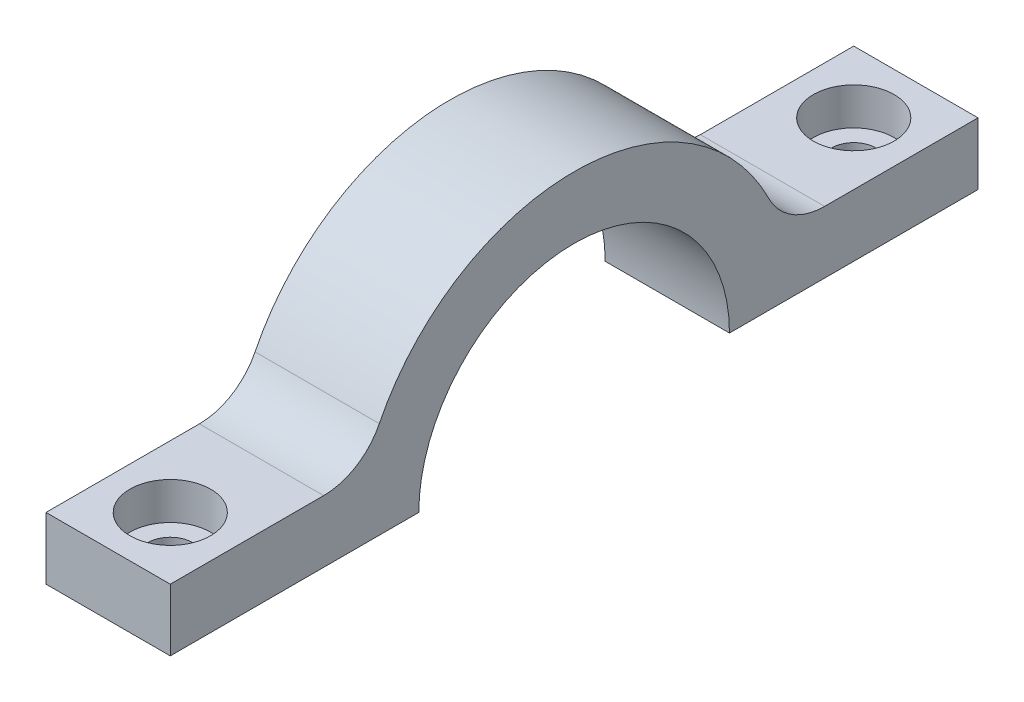
ISO-10303-21;
HEADER;
FILE_DESCRIPTION(('STEP AP214'),'2;1');
FILE_NAME('part.step','',(''),(''),'','','');
FILE_SCHEMA(('AUTOMOTIVE_DESIGN { 1 0 10303 214 1 1 1 1 }'));
ENDSEC;
DATA;
#1=APPLICATION_CONTEXT('core data for automotive mechanical design processes');
#2=APPLICATION_PROTOCOL_DEFINITION('international standard','automotive_design',2000,#1);
#3=PRODUCT_CONTEXT('',#1,'mechanical');
#4=PRODUCT('Part','Part','',(#3));
#5=PRODUCT_RELATED_PRODUCT_CATEGORY('part','',(#4));
#6=PRODUCT_DEFINITION_FORMATION('','',#4);
#7=PRODUCT_DEFINITION_CONTEXT('part definition',#1,'design');
#8=PRODUCT_DEFINITION('design','',#6,#7);
#9=PRODUCT_DEFINITION_SHAPE('','',#8);
#10=(LENGTH_UNIT() NAMED_UNIT(*) SI_UNIT(.MILLI.,.METRE.));
#11=(NAMED_UNIT(*) PLANE_ANGLE_UNIT() SI_UNIT($,.RADIAN.));
#12=(NAMED_UNIT(*) SI_UNIT($,.STERADIAN.) SOLID_ANGLE_UNIT());
#13=UNCERTAINTY_MEASURE_WITH_UNIT(LENGTH_MEASURE(1.E-05),#10,'distance_accuracy_value','');
#14=(GEOMETRIC_REPRESENTATION_CONTEXT(3) GLOBAL_UNCERTAINTY_ASSIGNED_CONTEXT((#13)) GLOBAL_UNIT_ASSIGNED_CONTEXT((#10,
#11,#12)) REPRESENTATION_CONTEXT('',''));
#15=CARTESIAN_POINT('',(0.,0.,0.));
#16=DIRECTION('',(0.,0.,1.));
#17=DIRECTION('',(1.,0.,0.));
#18=AXIS2_PLACEMENT_3D('',#15,#16,#17);
#19=CARTESIAN_POINT('',(5.,0.,0.));
#20=DIRECTION('',(-1.,0.,0.));
#21=DIRECTION('',(0.,0.,1.));
#22=AXIS2_PLACEMENT_3D('',#19,#20,#21);
#23=CYLINDRICAL_SURFACE('',#22,12.5);
#24=CARTESIAN_POINT('',(-5.,0.,0.));
#25=DIRECTION('',(-1.,0.,0.));
#26=DIRECTION('',(0.,0.,1.));
#27=AXIS2_PLACEMENT_3D('',#24,#25,#26);
#28=CIRCLE('',#27,12.5);
#29=CARTESIAN_POINT('',(-5.,0.,12.5));
#30=VERTEX_POINT('',#29);
#31=CARTESIAN_POINT('',(-5.,0.,-12.5));
#32=VERTEX_POINT('',#31);
#33=EDGE_CURVE('E136',#30,#32,#28,.T.);
#34=ORIENTED_EDGE('',*,*,#33,.T.);
#35=DIRECTION('',(-1.,0.,0.));
#36=VECTOR('',#35,1.);
#37=CARTESIAN_POINT('',(5.,0.,-12.5));
#38=LINE('',#37,#36);
#39=CARTESIAN_POINT('',(5.,0.,-12.5));
#40=VERTEX_POINT('',#39);
#41=EDGE_CURVE('E118',#40,#32,#38,.T.);
#42=ORIENTED_EDGE('',*,*,#41,.F.);
#43=CARTESIAN_POINT('',(5.,0.,0.));
#44=DIRECTION('',(-1.,0.,0.));
#45=DIRECTION('',(0.,0.,1.));
#46=AXIS2_PLACEMENT_3D('',#43,#44,#45);
#47=CIRCLE('',#46,12.5);
#48=CARTESIAN_POINT('',(5.,0.,12.5));
#49=VERTEX_POINT('',#48);
#50=EDGE_CURVE('E124',#49,#40,#47,.T.);
#51=ORIENTED_EDGE('',*,*,#50,.F.);
#52=DIRECTION('',(-1.,0.,0.));
#53=VECTOR('',#52,1.);
#54=CARTESIAN_POINT('',(5.,0.,12.5));
#55=LINE('',#54,#53);
#56=EDGE_CURVE('E184',#49,#30,#55,.T.);
#57=ORIENTED_EDGE('',*,*,#56,.T.);
#58=EDGE_LOOP('',(#34,#42,#51,#57));
#59=FACE_BOUND('',#58,.T.);
#60=ADVANCED_FACE('F38',(#59),#23,.F.);
#61=CARTESIAN_POINT('',(5.,0.,-32.5));
#62=DIRECTION('',(0.,1.,0.));
#63=DIRECTION('',(0.,0.,1.));
#64=AXIS2_PLACEMENT_3D('',#61,#62,#63);
#65=PLANE('',#64);
#66=CARTESIAN_POINT('',(0.,0.,-27.5));
#67=DIRECTION('',(0.,1.,0.));
#68=DIRECTION('',(0.,0.,1.));
#69=AXIS2_PLACEMENT_3D('',#66,#67,#68);
#70=CIRCLE('',#69,1.8);
#71=CARTESIAN_POINT('',(0.,0.,-25.7));
#72=VERTEX_POINT('',#71);
#73=EDGE_CURVE('E187',#72,#72,#70,.T.);
#74=ORIENTED_EDGE('',*,*,#73,.T.);
#75=EDGE_LOOP('',(#74));
#76=FACE_BOUND('',#75,.T.);
#77=DIRECTION('',(0.,0.,-1.));
#78=VECTOR('',#77,1.);
#79=CARTESIAN_POINT('',(-5.,0.,-32.5));
#80=LINE('',#79,#78);
#81=CARTESIAN_POINT('',(-5.,0.,-32.5));
#82=VERTEX_POINT('',#81);
#83=EDGE_CURVE('E186',#32,#82,#80,.T.);
#84=ORIENTED_EDGE('',*,*,#83,.T.);
#85=DIRECTION('',(-1.,0.,0.));
#86=VECTOR('',#85,1.);
#87=CARTESIAN_POINT('',(5.,0.,-32.5));
#88=LINE('',#87,#86);
#89=CARTESIAN_POINT('',(5.,0.,-32.5));
#90=VERTEX_POINT('',#89);
#91=EDGE_CURVE('E121',#90,#82,#88,.T.);
#92=ORIENTED_EDGE('',*,*,#91,.F.);
#93=DIRECTION('',(0.,0.,-1.));
#94=VECTOR('',#93,1.);
#95=CARTESIAN_POINT('',(5.,0.,-32.5));
#96=LINE('',#95,#94);
#97=EDGE_CURVE('E114',#40,#90,#96,.T.);
#98=ORIENTED_EDGE('',*,*,#97,.F.);
#99=ORIENTED_EDGE('',*,*,#41,.T.);
#100=EDGE_LOOP('',(#84,#92,#98,#99));
#101=FACE_BOUND('',#100,.T.);
#102=ADVANCED_FACE('F116',(#76,#101),#65,.F.);
#103=CARTESIAN_POINT('',(5.,5.,-32.5));
#104=DIRECTION('',(0.,0.,1.));
#105=DIRECTION('',(1.,0.,0.));
#106=AXIS2_PLACEMENT_3D('',#103,#104,#105);
#107=PLANE('',#106);
#108=DIRECTION('',(0.,1.,0.));
#109=VECTOR('',#108,1.);
#110=CARTESIAN_POINT('',(-5.,5.,-32.5));
#111=LINE('',#110,#109);
#112=CARTESIAN_POINT('',(-5.,5.,-32.5));
#113=VERTEX_POINT('',#112);
#114=EDGE_CURVE('E189',#82,#113,#111,.T.);
#115=ORIENTED_EDGE('',*,*,#114,.T.);
#116=DIRECTION('',(-1.,0.,0.));
#117=VECTOR('',#116,1.);
#118=CARTESIAN_POINT('',(5.,5.,-32.5));
#119=LINE('',#118,#117);
#120=CARTESIAN_POINT('',(5.,5.,-32.5));
#121=VERTEX_POINT('',#120);
#122=EDGE_CURVE('E141',#121,#113,#119,.T.);
#123=ORIENTED_EDGE('',*,*,#122,.F.);
#124=DIRECTION('',(0.,1.,0.));
#125=VECTOR('',#124,1.);
#126=CARTESIAN_POINT('',(5.,5.,-32.5));
#127=LINE('',#126,#125);
#128=EDGE_CURVE('E123',#90,#121,#127,.T.);
#129=ORIENTED_EDGE('',*,*,#128,.F.);
#130=ORIENTED_EDGE('',*,*,#91,.T.);
#131=EDGE_LOOP('',(#115,#123,#129,#130));
#132=FACE_BOUND('',#131,.T.);
#133=ADVANCED_FACE('F259',(#132),#107,.F.);
#134=CARTESIAN_POINT('',(5.,5.,-32.5));
#135=DIRECTION('',(0.,-1.,0.));
#136=DIRECTION('',(0.,0.,-1.));
#137=AXIS2_PLACEMENT_3D('',#134,#135,#136);
#138=PLANE('',#137);
#139=CARTESIAN_POINT('',(0.,5.,-27.5));
#140=DIRECTION('',(0.,1.,0.));
#141=DIRECTION('',(0.,0.,1.));
#142=AXIS2_PLACEMENT_3D('',#139,#140,#141);
#143=CIRCLE('',#142,3.25);
#144=CARTESIAN_POINT('',(0.,5.,-24.25));
#145=VERTEX_POINT('',#144);
#146=EDGE_CURVE('E224',#145,#145,#143,.T.);
#147=ORIENTED_EDGE('',*,*,#146,.F.);
#148=EDGE_LOOP('',(#147));
#149=FACE_BOUND('',#148,.T.);
#150=DIRECTION('',(0.,0.,1.));
#151=VECTOR('',#150,1.);
#152=CARTESIAN_POINT('',(-5.,5.,-32.5));
#153=LINE('',#152,#151);
#154=CARTESIAN_POINT('',(-5.,5.,-20.1556443707464));
#155=VERTEX_POINT('',#154);
#156=EDGE_CURVE('E166',#113,#155,#153,.T.);
#157=ORIENTED_EDGE('',*,*,#156,.T.);
#158=DIRECTION('',(1.,0.,0.));
#159=VECTOR('',#158,1.);
#160=CARTESIAN_POINT('',(5.,5.,-20.1556443707464));
#161=LINE('',#160,#159);
#162=CARTESIAN_POINT('',(5.,5.,-20.1556443707464));
#163=VERTEX_POINT('',#162);
#164=EDGE_CURVE('E147',#155,#163,#161,.T.);
#165=ORIENTED_EDGE('',*,*,#164,.T.);
#166=DIRECTION('',(0.,0.,1.));
#167=VECTOR('',#166,1.);
#168=CARTESIAN_POINT('',(5.,5.,-32.5));
#169=LINE('',#168,#167);
#170=EDGE_CURVE('E179',#121,#163,#169,.T.);
#171=ORIENTED_EDGE('',*,*,#170,.F.);
#172=ORIENTED_EDGE('',*,*,#122,.T.);
#173=EDGE_LOOP('',(#157,#165,#171,#172));
#174=FACE_BOUND('',#173,.T.);
#175=ADVANCED_FACE('F206',(#149,#174),#138,.F.);
#176=CARTESIAN_POINT('',(5.,0.,0.));
#177=DIRECTION('',(-1.,0.,0.));
#178=DIRECTION('',(0.,0.,1.));
#179=AXIS2_PLACEMENT_3D('',#176,#177,#178);
#180=CYLINDRICAL_SURFACE('',#179,17.5);
#181=CARTESIAN_POINT('',(5.,0.,0.));
#182=DIRECTION('',(1.,0.,0.));
#183=DIRECTION('',(0.,0.,1.));
#184=AXIS2_PLACEMENT_3D('',#181,#182,#183);
#185=CIRCLE('',#184,17.5);
#186=CARTESIAN_POINT('',(5.,7.77777777777778,-15.6766122883583));
#187=VERTEX_POINT('',#186);
#188=CARTESIAN_POINT('',(5.,7.77777777777778,15.6766122883583));
#189=VERTEX_POINT('',#188);
#190=EDGE_CURVE('E176',#187,#189,#185,.T.);
#191=ORIENTED_EDGE('',*,*,#190,.F.);
#192=DIRECTION('',(-1.,0.,0.));
#193=VECTOR('',#192,1.);
#194=CARTESIAN_POINT('',(5.,7.77777777777778,-15.6766122883583));
#195=LINE('',#194,#193);
#196=CARTESIAN_POINT('',(-5.,7.77777777777778,-15.6766122883583));
#197=VERTEX_POINT('',#196);
#198=EDGE_CURVE('E139',#187,#197,#195,.T.);
#199=ORIENTED_EDGE('',*,*,#198,.T.);
#200=CARTESIAN_POINT('',(-5.,0.,0.));
#201=DIRECTION('',(1.,0.,0.));
#202=DIRECTION('',(0.,0.,1.));
#203=AXIS2_PLACEMENT_3D('',#200,#201,#202);
#204=CIRCLE('',#203,17.5);
#205=CARTESIAN_POINT('',(-5.,7.77777777777778,15.6766122883583));
#206=VERTEX_POINT('',#205);
#207=EDGE_CURVE('E159',#197,#206,#204,.T.);
#208=ORIENTED_EDGE('',*,*,#207,.T.);
#209=DIRECTION('',(-1.,0.,0.));
#210=VECTOR('',#209,1.);
#211=CARTESIAN_POINT('',(5.,7.77777777777778,15.6766122883583));
#212=LINE('',#211,#210);
#213=EDGE_CURVE('E137',#206,#189,#212,.F.);
#214=ORIENTED_EDGE('',*,*,#213,.T.);
#215=EDGE_LOOP('',(#191,#199,#208,#214));
#216=FACE_BOUND('',#215,.T.);
#217=ADVANCED_FACE('F164',(#216),#180,.T.);
#218=CARTESIAN_POINT('',(5.,5.,32.5));
#219=DIRECTION('',(0.,-1.,0.));
#220=DIRECTION('',(0.,0.,-1.));
#221=AXIS2_PLACEMENT_3D('',#218,#219,#220);
#222=PLANE('',#221);
#223=CARTESIAN_POINT('',(0.,5.,27.5));
#224=DIRECTION('',(0.,1.,0.));
#225=DIRECTION('',(0.,0.,1.));
#226=AXIS2_PLACEMENT_3D('',#223,#224,#225);
#227=CIRCLE('',#226,3.25);
#228=CARTESIAN_POINT('',(0.,5.,30.75));
#229=VERTEX_POINT('',#228);
#230=EDGE_CURVE('E236',#229,#229,#227,.T.);
#231=ORIENTED_EDGE('',*,*,#230,.F.);
#232=EDGE_LOOP('',(#231));
#233=FACE_BOUND('',#232,.T.);
#234=DIRECTION('',(0.,0.,1.));
#235=VECTOR('',#234,1.);
#236=CARTESIAN_POINT('',(5.,5.,32.5));
#237=LINE('',#236,#235);
#238=CARTESIAN_POINT('',(5.,5.,20.1556443707464));
#239=VERTEX_POINT('',#238);
#240=CARTESIAN_POINT('',(5.,5.,32.5));
#241=VERTEX_POINT('',#240);
#242=EDGE_CURVE('E172',#239,#241,#237,.T.);
#243=ORIENTED_EDGE('',*,*,#242,.F.);
#244=DIRECTION('',(1.,0.,0.));
#245=VECTOR('',#244,1.);
#246=CARTESIAN_POINT('',(-5.,5.,20.1556443707464));
#247=LINE('',#246,#245);
#248=CARTESIAN_POINT('',(-5.,5.,20.1556443707464));
#249=VERTEX_POINT('',#248);
#250=EDGE_CURVE('E149',#239,#249,#247,.F.);
#251=ORIENTED_EDGE('',*,*,#250,.T.);
#252=DIRECTION('',(0.,0.,1.));
#253=VECTOR('',#252,1.);
#254=CARTESIAN_POINT('',(-5.,5.,32.5));
#255=LINE('',#254,#253);
#256=CARTESIAN_POINT('',(-5.,5.,32.5));
#257=VERTEX_POINT('',#256);
#258=EDGE_CURVE('E161',#249,#257,#255,.T.);
#259=ORIENTED_EDGE('',*,*,#258,.T.);
#260=DIRECTION('',(-1.,0.,0.));
#261=VECTOR('',#260,1.);
#262=CARTESIAN_POINT('',(5.,5.,32.5));
#263=LINE('',#262,#261);
#264=EDGE_CURVE('E173',#241,#257,#263,.T.);
#265=ORIENTED_EDGE('',*,*,#264,.F.);
#266=EDGE_LOOP('',(#243,#251,#259,#265));
#267=FACE_BOUND('',#266,.T.);
#268=ADVANCED_FACE('F169',(#233,#267),#222,.F.);
#269=CARTESIAN_POINT('',(5.,5.,32.5));
#270=DIRECTION('',(0.,0.,-1.));
#271=DIRECTION('',(-1.,0.,0.));
#272=AXIS2_PLACEMENT_3D('',#269,#270,#271);
#273=PLANE('',#272);
#274=DIRECTION('',(0.,-1.,0.));
#275=VECTOR('',#274,1.);
#276=CARTESIAN_POINT('',(-5.,5.,32.5));
#277=LINE('',#276,#275);
#278=CARTESIAN_POINT('',(-5.,0.,32.5));
#279=VERTEX_POINT('',#278);
#280=EDGE_CURVE('E194',#257,#279,#277,.T.);
#281=ORIENTED_EDGE('',*,*,#280,.T.);
#282=DIRECTION('',(-1.,0.,0.));
#283=VECTOR('',#282,1.);
#284=CARTESIAN_POINT('',(5.,0.,32.5));
#285=LINE('',#284,#283);
#286=CARTESIAN_POINT('',(5.,0.,32.5));
#287=VERTEX_POINT('',#286);
#288=EDGE_CURVE('E198',#287,#279,#285,.T.);
#289=ORIENTED_EDGE('',*,*,#288,.F.);
#290=DIRECTION('',(0.,-1.,0.));
#291=VECTOR('',#290,1.);
#292=CARTESIAN_POINT('',(5.,5.,32.5));
#293=LINE('',#292,#291);
#294=EDGE_CURVE('E175',#241,#287,#293,.T.);
#295=ORIENTED_EDGE('',*,*,#294,.F.);
#296=ORIENTED_EDGE('',*,*,#264,.T.);
#297=EDGE_LOOP('',(#281,#289,#295,#296));
#298=FACE_BOUND('',#297,.T.);
#299=ADVANCED_FACE('F243',(#298),#273,.F.);
#300=CARTESIAN_POINT('',(5.,0.,32.5));
#301=DIRECTION('',(0.,1.,0.));
#302=DIRECTION('',(0.,0.,1.));
#303=AXIS2_PLACEMENT_3D('',#300,#301,#302);
#304=PLANE('',#303);
#305=CARTESIAN_POINT('',(0.,0.,27.5));
#306=DIRECTION('',(0.,1.,0.));
#307=DIRECTION('',(0.,0.,1.));
#308=AXIS2_PLACEMENT_3D('',#305,#306,#307);
#309=CIRCLE('',#308,1.8);
#310=CARTESIAN_POINT('',(0.,0.,29.3));
#311=VERTEX_POINT('',#310);
#312=EDGE_CURVE('E227',#311,#311,#309,.T.);
#313=ORIENTED_EDGE('',*,*,#312,.T.);
#314=EDGE_LOOP('',(#313));
#315=FACE_BOUND('',#314,.T.);
#316=DIRECTION('',(0.,0.,-1.));
#317=VECTOR('',#316,1.);
#318=CARTESIAN_POINT('',(-5.,0.,32.5));
#319=LINE('',#318,#317);
#320=EDGE_CURVE('E133',#279,#30,#319,.T.);
#321=ORIENTED_EDGE('',*,*,#320,.T.);
#322=ORIENTED_EDGE('',*,*,#56,.F.);
#323=DIRECTION('',(0.,0.,-1.));
#324=VECTOR('',#323,1.);
#325=CARTESIAN_POINT('',(5.,0.,32.5));
#326=LINE('',#325,#324);
#327=EDGE_CURVE('E129',#287,#49,#326,.T.);
#328=ORIENTED_EDGE('',*,*,#327,.F.);
#329=ORIENTED_EDGE('',*,*,#288,.T.);
#330=EDGE_LOOP('',(#321,#322,#328,#329));
#331=FACE_BOUND('',#330,.T.);
#332=ADVANCED_FACE('F250',(#315,#331),#304,.F.);
#333=CARTESIAN_POINT('',(5.,0.,0.));
#334=DIRECTION('',(-1.,0.,0.));
#335=DIRECTION('',(0.,0.,1.));
#336=AXIS2_PLACEMENT_3D('',#333,#334,#335);
#337=PLANE('',#336);
#338=ORIENTED_EDGE('',*,*,#50,.T.);
#339=ORIENTED_EDGE('',*,*,#97,.T.);
#340=ORIENTED_EDGE('',*,*,#128,.T.);
#341=ORIENTED_EDGE('',*,*,#170,.T.);
#342=CARTESIAN_POINT('',(5.,10.,-20.1556443707464));
#343=DIRECTION('',(-1.,0.,0.));
#344=DIRECTION('',(0.,0.,1.));
#345=AXIS2_PLACEMENT_3D('',#342,#343,#344);
#346=CIRCLE('',#345,5.);
#347=EDGE_CURVE('E153',#163,#187,#346,.T.);
#348=ORIENTED_EDGE('',*,*,#347,.T.);
#349=ORIENTED_EDGE('',*,*,#190,.T.);
#350=CARTESIAN_POINT('',(5.,10.,20.1556443707464));
#351=DIRECTION('',(-1.,0.,0.));
#352=DIRECTION('',(0.,0.,1.));
#353=AXIS2_PLACEMENT_3D('',#350,#351,#352);
#354=CIRCLE('',#353,5.);
#355=EDGE_CURVE('E11',#189,#239,#354,.T.);
#356=ORIENTED_EDGE('',*,*,#355,.T.);
#357=ORIENTED_EDGE('',*,*,#242,.T.);
#358=ORIENTED_EDGE('',*,*,#294,.T.);
#359=ORIENTED_EDGE('',*,*,#327,.T.);
#360=EDGE_LOOP('',(#338,#339,#340,#341,#348,#349,#356,#357,#358,#359));
#361=FACE_BOUND('',#360,.T.);
#362=ADVANCED_FACE('F127',(#361),#337,.F.);
#363=CARTESIAN_POINT('',(-5.,0.,0.));
#364=DIRECTION('',(-1.,0.,0.));
#365=DIRECTION('',(0.,0.,1.));
#366=AXIS2_PLACEMENT_3D('',#363,#364,#365);
#367=PLANE('',#366);
#368=ORIENTED_EDGE('',*,*,#33,.F.);
#369=ORIENTED_EDGE('',*,*,#320,.F.);
#370=ORIENTED_EDGE('',*,*,#280,.F.);
#371=ORIENTED_EDGE('',*,*,#258,.F.);
#372=CARTESIAN_POINT('',(-5.,10.,20.1556443707464));
#373=DIRECTION('',(-1.,0.,0.));
#374=DIRECTION('',(0.,0.,1.));
#375=AXIS2_PLACEMENT_3D('',#372,#373,#374);
#376=CIRCLE('',#375,5.);
#377=EDGE_CURVE('E46',#249,#206,#376,.F.);
#378=ORIENTED_EDGE('',*,*,#377,.T.);
#379=ORIENTED_EDGE('',*,*,#207,.F.);
#380=CARTESIAN_POINT('',(-5.,10.,-20.1556443707464));
#381=DIRECTION('',(-1.,0.,0.));
#382=DIRECTION('',(0.,0.,1.));
#383=AXIS2_PLACEMENT_3D('',#380,#381,#382);
#384=CIRCLE('',#383,5.);
#385=EDGE_CURVE('E151',#197,#155,#384,.F.);
#386=ORIENTED_EDGE('',*,*,#385,.T.);
#387=ORIENTED_EDGE('',*,*,#156,.F.);
#388=ORIENTED_EDGE('',*,*,#114,.F.);
#389=ORIENTED_EDGE('',*,*,#83,.F.);
#390=EDGE_LOOP('',(#368,#369,#370,#371,#378,#379,#386,#387,#388,#389));
#391=FACE_BOUND('',#390,.T.);
#392=ADVANCED_FACE('F158',(#391),#367,.T.);
#393=CARTESIAN_POINT('',(0.,5.,-27.5));
#394=DIRECTION('',(0.,1.,0.));
#395=DIRECTION('',(0.,0.,1.));
#396=AXIS2_PLACEMENT_3D('',#393,#394,#395);
#397=CYLINDRICAL_SURFACE('',#396,1.8);
#398=ORIENTED_EDGE('',*,*,#73,.F.);
#399=EDGE_LOOP('',(#398));
#400=FACE_BOUND('',#399,.T.);
#401=CARTESIAN_POINT('',(0.,2.,-27.5));
#402=DIRECTION('',(0.,1.,0.));
#403=DIRECTION('',(0.,0.,1.));
#404=AXIS2_PLACEMENT_3D('',#401,#402,#403);
#405=CIRCLE('',#404,1.8);
#406=CARTESIAN_POINT('',(0.,2.,-25.7));
#407=VERTEX_POINT('',#406);
#408=EDGE_CURVE('E218',#407,#407,#405,.T.);
#409=ORIENTED_EDGE('',*,*,#408,.T.);
#410=EDGE_LOOP('',(#409));
#411=FACE_BOUND('',#410,.T.);
#412=ADVANCED_FACE('F289',(#400,#411),#397,.F.);
#413=CARTESIAN_POINT('',(1.8,2.,-27.5));
#414=DIRECTION('',(0.,-1.,0.));
#415=DIRECTION('',(0.,0.,-1.));
#416=AXIS2_PLACEMENT_3D('',#413,#414,#415);
#417=PLANE('',#416);
#418=ORIENTED_EDGE('',*,*,#408,.F.);
#419=EDGE_LOOP('',(#418));
#420=FACE_BOUND('',#419,.T.);
#421=CARTESIAN_POINT('',(0.,2.,-27.5));
#422=DIRECTION('',(0.,1.,0.));
#423=DIRECTION('',(0.,0.,1.));
#424=AXIS2_PLACEMENT_3D('',#421,#422,#423);
#425=CIRCLE('',#424,3.25);
#426=CARTESIAN_POINT('',(0.,2.,-24.25));
#427=VERTEX_POINT('',#426);
#428=EDGE_CURVE('E221',#427,#427,#425,.T.);
#429=ORIENTED_EDGE('',*,*,#428,.T.);
#430=EDGE_LOOP('',(#429));
#431=FACE_BOUND('',#430,.T.);
#432=ADVANCED_FACE('F285',(#420,#431),#417,.F.);
#433=CARTESIAN_POINT('',(0.,5.,-27.5));
#434=DIRECTION('',(0.,1.,0.));
#435=DIRECTION('',(0.,0.,1.));
#436=AXIS2_PLACEMENT_3D('',#433,#434,#435);
#437=CYLINDRICAL_SURFACE('',#436,3.25);
#438=ORIENTED_EDGE('',*,*,#428,.F.);
#439=EDGE_LOOP('',(#438));
#440=FACE_BOUND('',#439,.T.);
#441=ORIENTED_EDGE('',*,*,#146,.T.);
#442=EDGE_LOOP('',(#441));
#443=FACE_BOUND('',#442,.T.);
#444=ADVANCED_FACE('F281',(#440,#443),#437,.F.);
#445=CARTESIAN_POINT('',(0.,5.,27.5));
#446=DIRECTION('',(0.,1.,0.));
#447=DIRECTION('',(0.,0.,1.));
#448=AXIS2_PLACEMENT_3D('',#445,#446,#447);
#449=CYLINDRICAL_SURFACE('',#448,1.8);
#450=ORIENTED_EDGE('',*,*,#312,.F.);
#451=EDGE_LOOP('',(#450));
#452=FACE_BOUND('',#451,.T.);
#453=CARTESIAN_POINT('',(0.,2.,27.5));
#454=DIRECTION('',(0.,1.,0.));
#455=DIRECTION('',(0.,0.,1.));
#456=AXIS2_PLACEMENT_3D('',#453,#454,#455);
#457=CIRCLE('',#456,1.8);
#458=CARTESIAN_POINT('',(0.,2.,29.3));
#459=VERTEX_POINT('',#458);
#460=EDGE_CURVE('E230',#459,#459,#457,.T.);
#461=ORIENTED_EDGE('',*,*,#460,.T.);
#462=EDGE_LOOP('',(#461));
#463=FACE_BOUND('',#462,.T.);
#464=ADVANCED_FACE('F274',(#452,#463),#449,.F.);
#465=CARTESIAN_POINT('',(1.79999999999999,2.,27.5));
#466=DIRECTION('',(0.,-1.,0.));
#467=DIRECTION('',(0.,0.,-1.));
#468=AXIS2_PLACEMENT_3D('',#465,#466,#467);
#469=PLANE('',#468);
#470=ORIENTED_EDGE('',*,*,#460,.F.);
#471=EDGE_LOOP('',(#470));
#472=FACE_BOUND('',#471,.T.);
#473=CARTESIAN_POINT('',(0.,2.,27.5));
#474=DIRECTION('',(0.,1.,0.));
#475=DIRECTION('',(0.,0.,1.));
#476=AXIS2_PLACEMENT_3D('',#473,#474,#475);
#477=CIRCLE('',#476,3.25);
#478=CARTESIAN_POINT('',(0.,2.,30.75));
#479=VERTEX_POINT('',#478);
#480=EDGE_CURVE('E233',#479,#479,#477,.T.);
#481=ORIENTED_EDGE('',*,*,#480,.T.);
#482=EDGE_LOOP('',(#481));
#483=FACE_BOUND('',#482,.T.);
#484=ADVANCED_FACE('F268',(#472,#483),#469,.F.);
#485=CARTESIAN_POINT('',(0.,5.,27.5));
#486=DIRECTION('',(0.,1.,0.));
#487=DIRECTION('',(0.,0.,1.));
#488=AXIS2_PLACEMENT_3D('',#485,#486,#487);
#489=CYLINDRICAL_SURFACE('',#488,3.25);
#490=ORIENTED_EDGE('',*,*,#480,.F.);
#491=EDGE_LOOP('',(#490));
#492=FACE_BOUND('',#491,.T.);
#493=ORIENTED_EDGE('',*,*,#230,.T.);
#494=EDGE_LOOP('',(#493));
#495=FACE_BOUND('',#494,.T.);
#496=ADVANCED_FACE('F240',(#492,#495),#489,.F.);
#497=CARTESIAN_POINT('',(5.,10.,-20.1556443707464));
#498=DIRECTION('',(-1.,0.,0.));
#499=DIRECTION('',(0.,0.,1.));
#500=AXIS2_PLACEMENT_3D('',#497,#498,#499);
#501=CYLINDRICAL_SURFACE('',#500,5.);
#502=ORIENTED_EDGE('',*,*,#347,.F.);
#503=ORIENTED_EDGE('',*,*,#164,.F.);
#504=ORIENTED_EDGE('',*,*,#385,.F.);
#505=ORIENTED_EDGE('',*,*,#198,.F.);
#506=EDGE_LOOP('',(#502,#503,#504,#505));
#507=FACE_BOUND('',#506,.T.);
#508=ADVANCED_FACE('F213',(#507),#501,.F.);
#509=CARTESIAN_POINT('',(5.,10.,20.1556443707464));
#510=DIRECTION('',(-1.,0.,0.));
#511=DIRECTION('',(0.,0.,1.));
#512=AXIS2_PLACEMENT_3D('',#509,#510,#511);
#513=CYLINDRICAL_SURFACE('',#512,5.);
#514=ORIENTED_EDGE('',*,*,#355,.F.);
#515=ORIENTED_EDGE('',*,*,#213,.F.);
#516=ORIENTED_EDGE('',*,*,#377,.F.);
#517=ORIENTED_EDGE('',*,*,#250,.F.);
#518=EDGE_LOOP('',(#514,#515,#516,#517));
#519=FACE_BOUND('',#518,.T.);
#520=ADVANCED_FACE('F40',(#519),#513,.F.);
#521=CLOSED_SHELL('',(#60,#102,#133,#175,#217,#268,#299,#332,#362,#392,#412,#432,#444,#464,#484,
#496,#508,#520));
#522=MANIFOLD_SOLID_BREP('B2',#521);
#523=ADVANCED_BREP_SHAPE_REPRESENTATION('',(#18,#522),#14);
#524=SHAPE_DEFINITION_REPRESENTATION(#9,#523);
ENDSEC;
END-ISO-10303-21;
